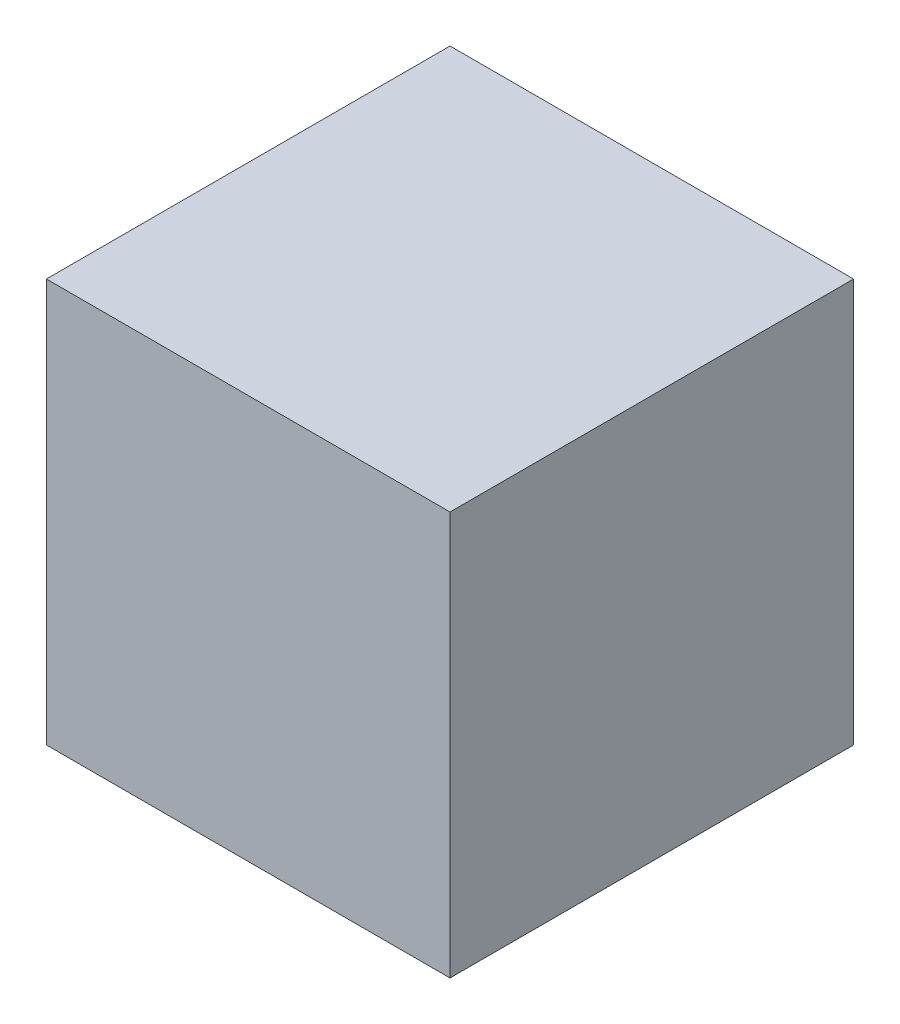
ISO-10303-21;
HEADER;
FILE_DESCRIPTION(('STEP AP214'),'2;1');
FILE_NAME('part.step','',(''),(''),'','','');
FILE_SCHEMA(('AUTOMOTIVE_DESIGN { 1 0 10303 214 1 1 1 1 }'));
ENDSEC;
DATA;
#1=APPLICATION_CONTEXT('core data for automotive mechanical design processes');
#2=APPLICATION_PROTOCOL_DEFINITION('international standard','automotive_design',2000,#1);
#3=PRODUCT_CONTEXT('',#1,'mechanical');
#4=PRODUCT('Part','Part','',(#3));
#5=PRODUCT_RELATED_PRODUCT_CATEGORY('part','',(#4));
#6=PRODUCT_DEFINITION_FORMATION('','',#4);
#7=PRODUCT_DEFINITION_CONTEXT('part definition',#1,'design');
#8=PRODUCT_DEFINITION('design','',#6,#7);
#9=PRODUCT_DEFINITION_SHAPE('','',#8);
#10=(LENGTH_UNIT() NAMED_UNIT(*) SI_UNIT(.MILLI.,.METRE.));
#11=(NAMED_UNIT(*) PLANE_ANGLE_UNIT() SI_UNIT($,.RADIAN.));
#12=(NAMED_UNIT(*) SI_UNIT($,.STERADIAN.) SOLID_ANGLE_UNIT());
#13=UNCERTAINTY_MEASURE_WITH_UNIT(LENGTH_MEASURE(1.E-05),#10,'distance_accuracy_value','');
#14=(GEOMETRIC_REPRESENTATION_CONTEXT(3) GLOBAL_UNCERTAINTY_ASSIGNED_CONTEXT((#13)) GLOBAL_UNIT_ASSIGNED_CONTEXT((#10,
#11,#12)) REPRESENTATION_CONTEXT('',''));
#15=CARTESIAN_POINT('',(0.,0.,0.));
#16=DIRECTION('',(0.,0.,1.));
#17=DIRECTION('',(1.,0.,0.));
#18=AXIS2_PLACEMENT_3D('',#15,#16,#17);
#19=CARTESIAN_POINT('',(5.,-5.,5.));
#20=DIRECTION('',(-1.,0.,0.));
#21=DIRECTION('',(0.,0.,1.));
#22=AXIS2_PLACEMENT_3D('',#19,#20,#21);
#23=PLANE('',#22);
#24=DIRECTION('',(0.,1.,0.));
#25=VECTOR('',#24,1.);
#26=CARTESIAN_POINT('',(5.,-5.,-5.));
#27=LINE('',#26,#25);
#28=CARTESIAN_POINT('',(5.,-5.,-5.));
#29=VERTEX_POINT('',#28);
#30=CARTESIAN_POINT('',(5.,5.,-5.));
#31=VERTEX_POINT('',#30);
#32=EDGE_CURVE('E114',#29,#31,#27,.T.);
#33=ORIENTED_EDGE('',*,*,#32,.T.);
#34=DIRECTION('',(0.,0.,-1.));
#35=VECTOR('',#34,1.);
#36=CARTESIAN_POINT('',(5.,5.,5.));
#37=LINE('',#36,#35);
#38=CARTESIAN_POINT('',(5.,5.,5.));
#39=VERTEX_POINT('',#38);
#40=EDGE_CURVE('E11',#39,#31,#37,.T.);
#41=ORIENTED_EDGE('',*,*,#40,.F.);
#42=DIRECTION('',(0.,1.,0.));
#43=VECTOR('',#42,1.);
#44=CARTESIAN_POINT('',(5.,-5.,5.));
#45=LINE('',#44,#43);
#46=CARTESIAN_POINT('',(5.,-5.,5.));
#47=VERTEX_POINT('',#46);
#48=EDGE_CURVE('E115',#47,#39,#45,.T.);
#49=ORIENTED_EDGE('',*,*,#48,.F.);
#50=DIRECTION('',(0.,0.,-1.));
#51=VECTOR('',#50,1.);
#52=CARTESIAN_POINT('',(5.,-5.,5.));
#53=LINE('',#52,#51);
#54=EDGE_CURVE('E121',#47,#29,#53,.T.);
#55=ORIENTED_EDGE('',*,*,#54,.T.);
#56=EDGE_LOOP('',(#33,#41,#49,#55));
#57=FACE_BOUND('',#56,.T.);
#58=ADVANCED_FACE('F39',(#57),#23,.F.);
#59=CARTESIAN_POINT('',(-5.,5.,5.));
#60=DIRECTION('',(0.,-1.,0.));
#61=DIRECTION('',(0.,0.,-1.));
#62=AXIS2_PLACEMENT_3D('',#59,#60,#61);
#63=PLANE('',#62);
#64=DIRECTION('',(-1.,0.,0.));
#65=VECTOR('',#64,1.);
#66=CARTESIAN_POINT('',(-5.,5.,-5.));
#67=LINE('',#66,#65);
#68=CARTESIAN_POINT('',(-5.,5.,-5.));
#69=VERTEX_POINT('',#68);
#70=EDGE_CURVE('E124',#31,#69,#67,.T.);
#71=ORIENTED_EDGE('',*,*,#70,.T.);
#72=DIRECTION('',(0.,0.,-1.));
#73=VECTOR('',#72,1.);
#74=CARTESIAN_POINT('',(-5.,5.,5.));
#75=LINE('',#74,#73);
#76=CARTESIAN_POINT('',(-5.,5.,5.));
#77=VERTEX_POINT('',#76);
#78=EDGE_CURVE('E47',#77,#69,#75,.T.);
#79=ORIENTED_EDGE('',*,*,#78,.F.);
#80=DIRECTION('',(-1.,0.,0.));
#81=VECTOR('',#80,1.);
#82=CARTESIAN_POINT('',(-5.,5.,5.));
#83=LINE('',#82,#81);
#84=EDGE_CURVE('E86',#39,#77,#83,.T.);
#85=ORIENTED_EDGE('',*,*,#84,.F.);
#86=ORIENTED_EDGE('',*,*,#40,.T.);
#87=EDGE_LOOP('',(#71,#79,#85,#86));
#88=FACE_BOUND('',#87,.T.);
#89=ADVANCED_FACE('F148',(#88),#63,.F.);
#90=CARTESIAN_POINT('',(-5.,-5.,5.));
#91=DIRECTION('',(1.,0.,0.));
#92=DIRECTION('',(0.,0.,-1.));
#93=AXIS2_PLACEMENT_3D('',#90,#91,#92);
#94=PLANE('',#93);
#95=DIRECTION('',(0.,-1.,0.));
#96=VECTOR('',#95,1.);
#97=CARTESIAN_POINT('',(-5.,-5.,-5.));
#98=LINE('',#97,#96);
#99=CARTESIAN_POINT('',(-5.,-5.,-5.));
#100=VERTEX_POINT('',#99);
#101=EDGE_CURVE('E73',#69,#100,#98,.T.);
#102=ORIENTED_EDGE('',*,*,#101,.T.);
#103=DIRECTION('',(0.,0.,-1.));
#104=VECTOR('',#103,1.);
#105=CARTESIAN_POINT('',(-5.,-5.,5.));
#106=LINE('',#105,#104);
#107=CARTESIAN_POINT('',(-5.,-5.,5.));
#108=VERTEX_POINT('',#107);
#109=EDGE_CURVE('E129',#108,#100,#106,.T.);
#110=ORIENTED_EDGE('',*,*,#109,.F.);
#111=DIRECTION('',(0.,-1.,0.));
#112=VECTOR('',#111,1.);
#113=CARTESIAN_POINT('',(-5.,-5.,5.));
#114=LINE('',#113,#112);
#115=EDGE_CURVE('E118',#77,#108,#114,.T.);
#116=ORIENTED_EDGE('',*,*,#115,.F.);
#117=ORIENTED_EDGE('',*,*,#78,.T.);
#118=EDGE_LOOP('',(#102,#110,#116,#117));
#119=FACE_BOUND('',#118,.T.);
#120=ADVANCED_FACE('F131',(#119),#94,.F.);
#121=CARTESIAN_POINT('',(-5.,-5.,5.));
#122=DIRECTION('',(0.,1.,0.));
#123=DIRECTION('',(0.,0.,1.));
#124=AXIS2_PLACEMENT_3D('',#121,#122,#123);
#125=PLANE('',#124);
#126=CARTESIAN_POINT('',(2.5,-5.,0.));
#127=DIRECTION('',(0.,-1.,0.));
#128=DIRECTION('',(0.,0.,-1.));
#129=AXIS2_PLACEMENT_3D('',#126,#127,#128);
#130=CIRCLE('',#129,1.24999999999999);
#131=CARTESIAN_POINT('',(2.5,-5.,-1.24999999999999));
#132=VERTEX_POINT('',#131);
#133=EDGE_CURVE('E104',#132,#132,#130,.T.);
#134=ORIENTED_EDGE('',*,*,#133,.F.);
#135=EDGE_LOOP('',(#134));
#136=FACE_BOUND('',#135,.T.);
#137=CARTESIAN_POINT('',(-2.5,-5.,0.));
#138=DIRECTION('',(0.,-1.,0.));
#139=DIRECTION('',(0.,0.,-1.));
#140=AXIS2_PLACEMENT_3D('',#137,#138,#139);
#141=CIRCLE('',#140,1.24999999999999);
#142=CARTESIAN_POINT('',(-2.5,-5.,-1.24999999999999));
#143=VERTEX_POINT('',#142);
#144=EDGE_CURVE('E103',#143,#143,#141,.T.);
#145=ORIENTED_EDGE('',*,*,#144,.F.);
#146=EDGE_LOOP('',(#145));
#147=FACE_BOUND('',#146,.T.);
#148=DIRECTION('',(1.,0.,0.));
#149=VECTOR('',#148,1.);
#150=CARTESIAN_POINT('',(-5.,-5.,-5.));
#151=LINE('',#150,#149);
#152=EDGE_CURVE('E79',#100,#29,#151,.T.);
#153=ORIENTED_EDGE('',*,*,#152,.T.);
#154=ORIENTED_EDGE('',*,*,#54,.F.);
#155=DIRECTION('',(1.,0.,0.));
#156=VECTOR('',#155,1.);
#157=CARTESIAN_POINT('',(-5.,-5.,5.));
#158=LINE('',#157,#156);
#159=EDGE_CURVE('E55',#108,#47,#158,.T.);
#160=ORIENTED_EDGE('',*,*,#159,.F.);
#161=ORIENTED_EDGE('',*,*,#109,.T.);
#162=EDGE_LOOP('',(#153,#154,#160,#161));
#163=FACE_BOUND('',#162,.T.);
#164=ADVANCED_FACE('F138',(#136,#147,#163),#125,.F.);
#165=CARTESIAN_POINT('',(0.,0.,5.));
#166=DIRECTION('',(0.,0.,-1.));
#167=DIRECTION('',(-1.,0.,0.));
#168=AXIS2_PLACEMENT_3D('',#165,#166,#167);
#169=PLANE('',#168);
#170=ORIENTED_EDGE('',*,*,#48,.T.);
#171=ORIENTED_EDGE('',*,*,#84,.T.);
#172=ORIENTED_EDGE('',*,*,#115,.T.);
#173=ORIENTED_EDGE('',*,*,#159,.T.);
#174=EDGE_LOOP('',(#170,#171,#172,#173));
#175=FACE_BOUND('',#174,.T.);
#176=ADVANCED_FACE('F140',(#175),#169,.F.);
#177=CARTESIAN_POINT('',(0.,0.,-5.));
#178=DIRECTION('',(0.,0.,-1.));
#179=DIRECTION('',(-1.,0.,0.));
#180=AXIS2_PLACEMENT_3D('',#177,#178,#179);
#181=PLANE('',#180);
#182=ORIENTED_EDGE('',*,*,#32,.F.);
#183=ORIENTED_EDGE('',*,*,#152,.F.);
#184=ORIENTED_EDGE('',*,*,#101,.F.);
#185=ORIENTED_EDGE('',*,*,#70,.F.);
#186=EDGE_LOOP('',(#182,#183,#184,#185));
#187=FACE_BOUND('',#186,.T.);
#188=ADVANCED_FACE('F134',(#187),#181,.T.);
#189=CARTESIAN_POINT('',(-2.5,1.74892422621555,0.));
#190=DIRECTION('',(0.,-1.,0.));
#191=DIRECTION('',(0.,0.,-1.));
#192=AXIS2_PLACEMENT_3D('',#189,#190,#191);
#193=CONICAL_SURFACE('',#192,1.25,1.02974425867665);
#194=CARTESIAN_POINT('',(-2.5,2.5,0.));
#195=VERTEX_POINT('',#194);
#196=VERTEX_LOOP('',#195);
#197=FACE_BOUND('',#196,.T.);
#198=CARTESIAN_POINT('',(-2.5,1.74892422621555,0.));
#199=DIRECTION('',(0.,-1.,0.));
#200=DIRECTION('',(0.,0.,-1.));
#201=AXIS2_PLACEMENT_3D('',#198,#199,#200);
#202=CIRCLE('',#201,1.25);
#203=CARTESIAN_POINT('',(-2.5,1.74892422621555,-1.25));
#204=VERTEX_POINT('',#203);
#205=EDGE_CURVE('E107',#204,#204,#202,.T.);
#206=ORIENTED_EDGE('',*,*,#205,.T.);
#207=EDGE_LOOP('',(#206));
#208=FACE_BOUND('',#207,.T.);
#209=ADVANCED_FACE('F179',(#197,#208),#193,.F.);
#210=CARTESIAN_POINT('',(-2.5,-5.,0.));
#211=DIRECTION('',(0.,-1.,0.));
#212=DIRECTION('',(0.,0.,-1.));
#213=AXIS2_PLACEMENT_3D('',#210,#211,#212);
#214=CYLINDRICAL_SURFACE('',#213,1.24999999999999);
#215=ORIENTED_EDGE('',*,*,#205,.F.);
#216=EDGE_LOOP('',(#215));
#217=FACE_BOUND('',#216,.T.);
#218=ORIENTED_EDGE('',*,*,#144,.T.);
#219=EDGE_LOOP('',(#218));
#220=FACE_BOUND('',#219,.T.);
#221=ADVANCED_FACE('F97',(#217,#220),#214,.F.);
#222=CARTESIAN_POINT('',(2.5,1.74892422621555,0.));
#223=DIRECTION('',(0.,-1.,0.));
#224=DIRECTION('',(0.,0.,-1.));
#225=AXIS2_PLACEMENT_3D('',#222,#223,#224);
#226=CONICAL_SURFACE('',#225,1.25,1.02974425867665);
#227=CARTESIAN_POINT('',(2.5,2.5,0.));
#228=VERTEX_POINT('',#227);
#229=VERTEX_LOOP('',#228);
#230=FACE_BOUND('',#229,.T.);
#231=CARTESIAN_POINT('',(2.5,1.74892422621555,0.));
#232=DIRECTION('',(0.,-1.,0.));
#233=DIRECTION('',(0.,0.,-1.));
#234=AXIS2_PLACEMENT_3D('',#231,#232,#233);
#235=CIRCLE('',#234,1.25);
#236=CARTESIAN_POINT('',(2.5,1.74892422621555,-1.25));
#237=VERTEX_POINT('',#236);
#238=EDGE_CURVE('E101',#237,#237,#235,.T.);
#239=ORIENTED_EDGE('',*,*,#238,.T.);
#240=EDGE_LOOP('',(#239));
#241=FACE_BOUND('',#240,.T.);
#242=ADVANCED_FACE('F93',(#230,#241),#226,.F.);
#243=CARTESIAN_POINT('',(2.5,-5.,0.));
#244=DIRECTION('',(0.,-1.,0.));
#245=DIRECTION('',(0.,0.,-1.));
#246=AXIS2_PLACEMENT_3D('',#243,#244,#245);
#247=CYLINDRICAL_SURFACE('',#246,1.24999999999999);
#248=ORIENTED_EDGE('',*,*,#238,.F.);
#249=EDGE_LOOP('',(#248));
#250=FACE_BOUND('',#249,.T.);
#251=ORIENTED_EDGE('',*,*,#133,.T.);
#252=EDGE_LOOP('',(#251));
#253=FACE_BOUND('',#252,.T.);
#254=ADVANCED_FACE('F96',(#250,#253),#247,.F.);
#255=CLOSED_SHELL('',(#58,#89,#120,#164,#176,#188,#209,#221,#242,#254));
#256=MANIFOLD_SOLID_BREP('B2',#255);
#257=ADVANCED_BREP_SHAPE_REPRESENTATION('',(#18,#256),#14);
#258=SHAPE_DEFINITION_REPRESENTATION(#9,#257);
ENDSEC;
END-ISO-10303-21;
